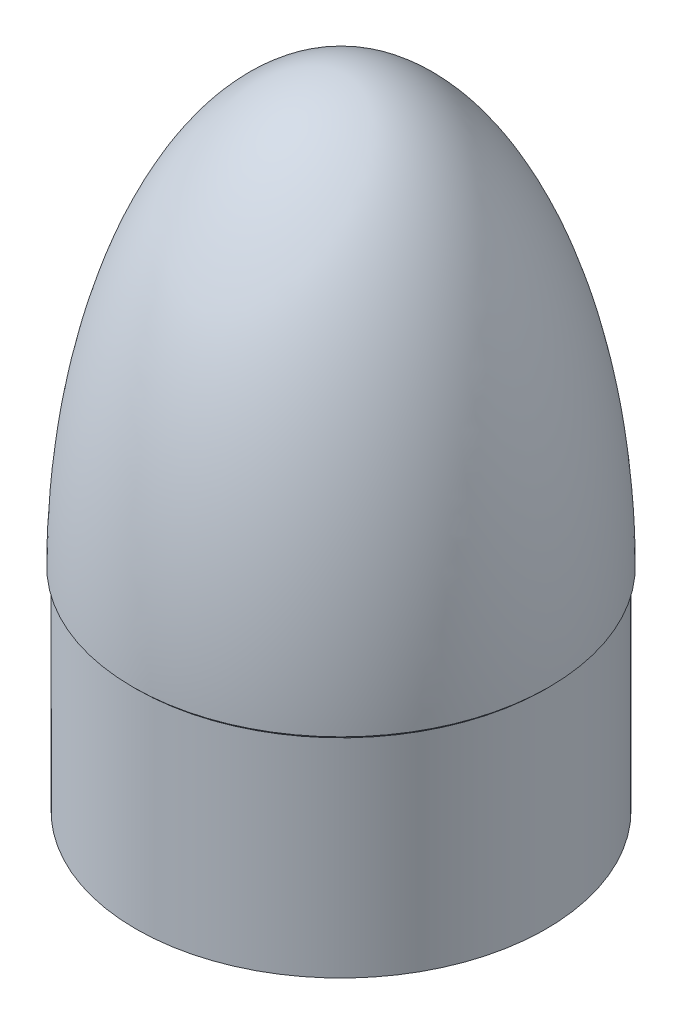
ISO-10303-21;
HEADER;
FILE_DESCRIPTION(('STEP AP214'),'2;1');
FILE_NAME('part.step','',(''),(''),'','','');
FILE_SCHEMA(('AUTOMOTIVE_DESIGN { 1 0 10303 214 1 1 1 1 }'));
ENDSEC;
DATA;
#1=APPLICATION_CONTEXT('core data for automotive mechanical design processes');
#2=APPLICATION_PROTOCOL_DEFINITION('international standard','automotive_design',2000,#1);
#3=PRODUCT_CONTEXT('',#1,'mechanical');
#4=PRODUCT('Part','Part','',(#3));
#5=PRODUCT_RELATED_PRODUCT_CATEGORY('part','',(#4));
#6=PRODUCT_DEFINITION_FORMATION('','',#4);
#7=PRODUCT_DEFINITION_CONTEXT('part definition',#1,'design');
#8=PRODUCT_DEFINITION('design','',#6,#7);
#9=PRODUCT_DEFINITION_SHAPE('','',#8);
#10=(LENGTH_UNIT() NAMED_UNIT(*) SI_UNIT(.MILLI.,.METRE.));
#11=(NAMED_UNIT(*) PLANE_ANGLE_UNIT() SI_UNIT($,.RADIAN.));
#12=(NAMED_UNIT(*) SI_UNIT($,.STERADIAN.) SOLID_ANGLE_UNIT());
#13=UNCERTAINTY_MEASURE_WITH_UNIT(LENGTH_MEASURE(1.E-05),#10,'distance_accuracy_value','');
#14=(GEOMETRIC_REPRESENTATION_CONTEXT(3) GLOBAL_UNCERTAINTY_ASSIGNED_CONTEXT((#13)) GLOBAL_UNIT_ASSIGNED_CONTEXT((#10,
#11,#12)) REPRESENTATION_CONTEXT('',''));
#15=CARTESIAN_POINT('',(0.,0.,0.));
#16=DIRECTION('',(0.,0.,1.));
#17=DIRECTION('',(1.,0.,0.));
#18=AXIS2_PLACEMENT_3D('',#15,#16,#17);
#19=CARTESIAN_POINT('',(0.,0.,0.));
#20=DIRECTION('',(0.,0.,1.));
#21=DIRECTION('',(0.,1.,0.));
#22=AXIS2_PLACEMENT_3D('',#19,#20,#21);
#23=ELLIPSE('',#22,165.1,80.518);
#24=TRIMMED_CURVE('',#23,(PARAMETER_VALUE(3.14159265358979)),
(PARAMETER_VALUE(6.28318530717959)),.T.,.PARAMETER.);
#25=CARTESIAN_POINT('',(0.,165.1,0.));
#26=DIRECTION('',(0.,1.,0.));
#27=AXIS1_PLACEMENT('',#25,#26);
#28=SURFACE_OF_REVOLUTION('',#24,#27);
#29=CARTESIAN_POINT('',(0.,165.1,0.));
#30=VERTEX_POINT('',#29);
#31=VERTEX_LOOP('',#30);
#32=FACE_BOUND('',#31,.T.);
#33=CARTESIAN_POINT('',(0.,0.,0.));
#34=DIRECTION('',(0.,1.,0.));
#35=DIRECTION('',(0.,0.,1.));
#36=AXIS2_PLACEMENT_3D('',#33,#34,#35);
#37=CIRCLE('',#36,80.518);
#38=CARTESIAN_POINT('',(0.,0.,80.518));
#39=VERTEX_POINT('',#38);
#40=EDGE_CURVE('E56',#39,#39,#37,.T.);
#41=ORIENTED_EDGE('',*,*,#40,.T.);
#42=EDGE_LOOP('',(#41));
#43=FACE_BOUND('',#42,.T.);
#44=ADVANCED_FACE('F36',(#32,#43),#28,.T.);
#45=CARTESIAN_POINT('',(0.,0.,0.));
#46=DIRECTION('',(0.,0.,-1.));
#47=DIRECTION('',(0.,1.,0.));
#48=AXIS2_PLACEMENT_3D('',#45,#46,#47);
#49=ELLIPSE('',#48,162.1,76.975);
#50=TRIMMED_CURVE('',#49,(PARAMETER_VALUE(0.)),(PARAMETER_VALUE(3.14159265358979)),.T.,.PARAMETER.);
#51=CARTESIAN_POINT('',(0.,165.1,0.));
#52=DIRECTION('',(0.,1.,0.));
#53=AXIS1_PLACEMENT('',#51,#52);
#54=SURFACE_OF_REVOLUTION('',#50,#53);
#55=CARTESIAN_POINT('',(0.,0.,0.));
#56=DIRECTION('',(0.,1.,0.));
#57=DIRECTION('',(0.,0.,1.));
#58=AXIS2_PLACEMENT_3D('',#55,#56,#57);
#59=CIRCLE('',#58,76.975);
#60=CARTESIAN_POINT('',(0.,0.,76.975));
#61=VERTEX_POINT('',#60);
#62=EDGE_CURVE('E11',#61,#61,#59,.T.);
#63=ORIENTED_EDGE('',*,*,#62,.F.);
#64=EDGE_LOOP('',(#63));
#65=FACE_BOUND('',#64,.T.);
#66=CARTESIAN_POINT('',(0.,162.1,0.));
#67=VERTEX_POINT('',#66);
#68=VERTEX_LOOP('',#67);
#69=FACE_BOUND('',#68,.T.);
#70=ADVANCED_FACE('F53',(#65,#69),#54,.T.);
#71=CARTESIAN_POINT('',(0.,165.1,0.));
#72=DIRECTION('',(0.,1.,0.));
#73=DIRECTION('',(0.,0.,1.));
#74=AXIS2_PLACEMENT_3D('',#71,#72,#73);
#75=CYLINDRICAL_SURFACE('',#74,76.975);
#76=CARTESIAN_POINT('',(0.,-81.661,0.));
#77=DIRECTION('',(0.,1.,0.));
#78=DIRECTION('',(0.,0.,1.));
#79=AXIS2_PLACEMENT_3D('',#76,#77,#78);
#80=CIRCLE('',#79,76.975);
#81=CARTESIAN_POINT('',(0.,-81.661,76.975));
#82=VERTEX_POINT('',#81);
#83=EDGE_CURVE('E45',#82,#82,#80,.T.);
#84=ORIENTED_EDGE('',*,*,#83,.F.);
#85=EDGE_LOOP('',(#84));
#86=FACE_BOUND('',#85,.T.);
#87=ORIENTED_EDGE('',*,*,#62,.T.);
#88=EDGE_LOOP('',(#87));
#89=FACE_BOUND('',#88,.T.);
#90=ADVANCED_FACE('F78',(#86,#89),#75,.F.);
#91=CARTESIAN_POINT('',(76.975,-81.661,0.));
#92=DIRECTION('',(0.,1.,0.));
#93=DIRECTION('',(0.,0.,1.));
#94=AXIS2_PLACEMENT_3D('',#91,#92,#93);
#95=PLANE('',#94);
#96=CARTESIAN_POINT('',(0.,-81.661,0.));
#97=DIRECTION('',(0.,1.,0.));
#98=DIRECTION('',(0.,0.,1.));
#99=AXIS2_PLACEMENT_3D('',#96,#97,#98);
#100=CIRCLE('',#99,79.375);
#101=CARTESIAN_POINT('',(0.,-81.661,79.375));
#102=VERTEX_POINT('',#101);
#103=EDGE_CURVE('E64',#102,#102,#100,.T.);
#104=ORIENTED_EDGE('',*,*,#103,.F.);
#105=EDGE_LOOP('',(#104));
#106=FACE_BOUND('',#105,.T.);
#107=ORIENTED_EDGE('',*,*,#83,.T.);
#108=EDGE_LOOP('',(#107));
#109=FACE_BOUND('',#108,.T.);
#110=ADVANCED_FACE('F76',(#106,#109),#95,.F.);
#111=CARTESIAN_POINT('',(0.,165.1,0.));
#112=DIRECTION('',(0.,1.,0.));
#113=DIRECTION('',(0.,0.,1.));
#114=AXIS2_PLACEMENT_3D('',#111,#112,#113);
#115=CYLINDRICAL_SURFACE('',#114,79.375);
#116=CARTESIAN_POINT('',(0.,-1.14299999999998,0.));
#117=DIRECTION('',(0.,1.,0.));
#118=DIRECTION('',(0.,0.,1.));
#119=AXIS2_PLACEMENT_3D('',#116,#117,#118);
#120=CIRCLE('',#119,79.375);
#121=CARTESIAN_POINT('',(0.,-1.14299999999998,79.375));
#122=VERTEX_POINT('',#121);
#123=EDGE_CURVE('E59',#122,#122,#120,.T.);
#124=ORIENTED_EDGE('',*,*,#123,.F.);
#125=EDGE_LOOP('',(#124));
#126=FACE_BOUND('',#125,.T.);
#127=ORIENTED_EDGE('',*,*,#103,.T.);
#128=EDGE_LOOP('',(#127));
#129=FACE_BOUND('',#128,.T.);
#130=ADVANCED_FACE('F90',(#126,#129),#115,.T.);
#131=CARTESIAN_POINT('',(0.,-1.14299999999998,0.));
#132=DIRECTION('',(0.,1.,0.));
#133=DIRECTION('',(0.,0.,1.));
#134=AXIS2_PLACEMENT_3D('',#131,#132,#133);
#135=CONICAL_SURFACE('',#134,79.375,0.785398163397454);
#136=ORIENTED_EDGE('',*,*,#40,.F.);
#137=EDGE_LOOP('',(#136));
#138=FACE_BOUND('',#137,.T.);
#139=ORIENTED_EDGE('',*,*,#123,.T.);
#140=EDGE_LOOP('',(#139));
#141=FACE_BOUND('',#140,.T.);
#142=ADVANCED_FACE('F94',(#138,#141),#135,.T.);
#143=CLOSED_SHELL('',(#44,#70,#90,#110,#130,#142));
#144=MANIFOLD_SOLID_BREP('B2',#143);
#145=ADVANCED_BREP_SHAPE_REPRESENTATION('',(#18,#144),#14);
#146=SHAPE_DEFINITION_REPRESENTATION(#9,#145);
ENDSEC;
END-ISO-10303-21;
